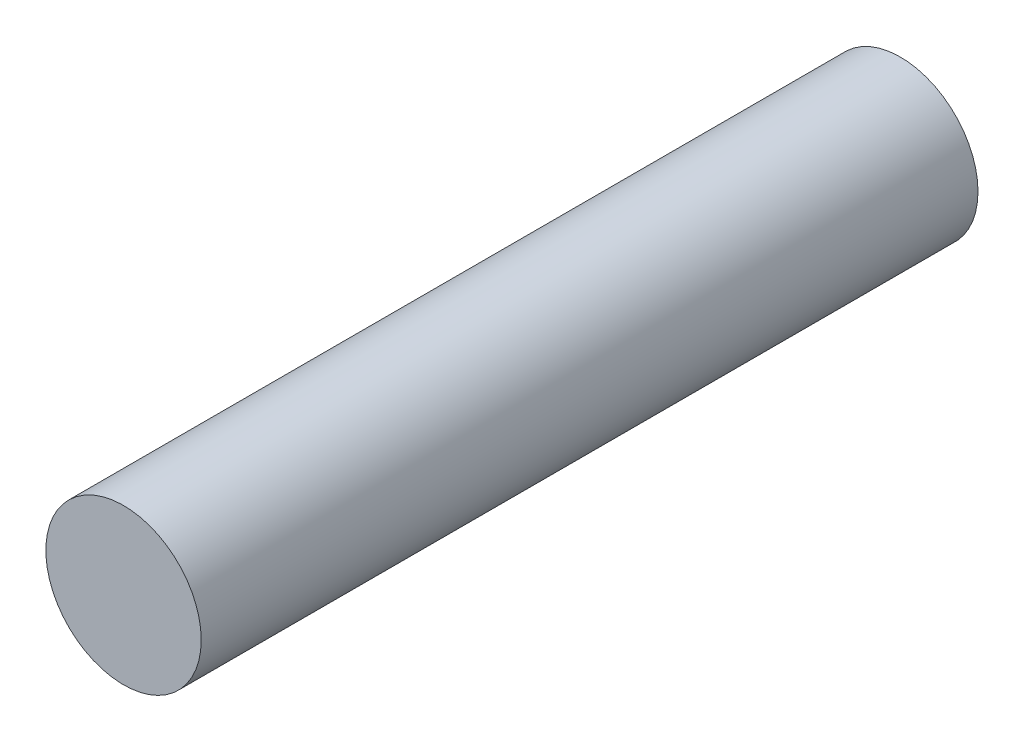
ISO-10303-21;
HEADER;
FILE_DESCRIPTION(('STEP AP214'),'2;1');
FILE_NAME('part.step','',(''),(''),'','','');
FILE_SCHEMA(('AUTOMOTIVE_DESIGN { 1 0 10303 214 1 1 1 1 }'));
ENDSEC;
DATA;
#1=APPLICATION_CONTEXT('core data for automotive mechanical design processes');
#2=APPLICATION_PROTOCOL_DEFINITION('international standard','automotive_design',2000,#1);
#3=PRODUCT_CONTEXT('',#1,'mechanical');
#4=PRODUCT('Part','Part','',(#3));
#5=PRODUCT_RELATED_PRODUCT_CATEGORY('part','',(#4));
#6=PRODUCT_DEFINITION_FORMATION('','',#4);
#7=PRODUCT_DEFINITION_CONTEXT('part definition',#1,'design');
#8=PRODUCT_DEFINITION('design','',#6,#7);
#9=PRODUCT_DEFINITION_SHAPE('','',#8);
#10=(LENGTH_UNIT() NAMED_UNIT(*) SI_UNIT(.MILLI.,.METRE.));
#11=(NAMED_UNIT(*) PLANE_ANGLE_UNIT() SI_UNIT($,.RADIAN.));
#12=(NAMED_UNIT(*) SI_UNIT($,.STERADIAN.) SOLID_ANGLE_UNIT());
#13=UNCERTAINTY_MEASURE_WITH_UNIT(LENGTH_MEASURE(1.E-05),#10,'distance_accuracy_value','');
#14=(GEOMETRIC_REPRESENTATION_CONTEXT(3) GLOBAL_UNCERTAINTY_ASSIGNED_CONTEXT((#13)) GLOBAL_UNIT_ASSIGNED_CONTEXT((#10,
#11,#12)) REPRESENTATION_CONTEXT('',''));
#15=CARTESIAN_POINT('',(0.,0.,0.));
#16=DIRECTION('',(0.,0.,1.));
#17=DIRECTION('',(1.,0.,0.));
#18=AXIS2_PLACEMENT_3D('',#15,#16,#17);
#19=CARTESIAN_POINT('',(0.,0.,-127.));
#20=DIRECTION('',(0.,0.,1.));
#21=DIRECTION('',(1.,0.,0.));
#22=AXIS2_PLACEMENT_3D('',#19,#20,#21);
#23=CYLINDRICAL_SURFACE('',#22,25.4);
#24=CARTESIAN_POINT('',(0.,0.,-127.));
#25=DIRECTION('',(0.,0.,1.));
#26=DIRECTION('',(1.,0.,0.));
#27=AXIS2_PLACEMENT_3D('',#24,#25,#26);
#28=CIRCLE('',#27,25.4);
#29=CARTESIAN_POINT('',(25.4,0.,-127.));
#30=VERTEX_POINT('',#29);
#31=EDGE_CURVE('E10',#30,#30,#28,.T.);
#32=ORIENTED_EDGE('',*,*,#31,.T.);
#33=EDGE_LOOP('',(#32));
#34=FACE_BOUND('',#33,.T.);
#35=CARTESIAN_POINT('',(0.,0.,127.));
#36=DIRECTION('',(0.,0.,1.));
#37=DIRECTION('',(1.,0.,0.));
#38=AXIS2_PLACEMENT_3D('',#35,#36,#37);
#39=CIRCLE('',#38,25.4);
#40=CARTESIAN_POINT('',(25.4,0.,127.));
#41=VERTEX_POINT('',#40);
#42=EDGE_CURVE('E45',#41,#41,#39,.T.);
#43=ORIENTED_EDGE('',*,*,#42,.F.);
#44=EDGE_LOOP('',(#43));
#45=FACE_BOUND('',#44,.T.);
#46=ADVANCED_FACE('F39',(#34,#45),#23,.T.);
#47=CARTESIAN_POINT('',(0.,0.,-127.));
#48=DIRECTION('',(0.,0.,1.));
#49=DIRECTION('',(1.,0.,0.));
#50=AXIS2_PLACEMENT_3D('',#47,#48,#49);
#51=PLANE('',#50);
#52=ORIENTED_EDGE('',*,*,#31,.F.);
#53=EDGE_LOOP('',(#52));
#54=FACE_BOUND('',#53,.T.);
#55=ADVANCED_FACE('F54',(#54),#51,.F.);
#56=CARTESIAN_POINT('',(0.,0.,127.));
#57=DIRECTION('',(0.,0.,1.));
#58=DIRECTION('',(1.,0.,0.));
#59=AXIS2_PLACEMENT_3D('',#56,#57,#58);
#60=PLANE('',#59);
#61=ORIENTED_EDGE('',*,*,#42,.T.);
#62=EDGE_LOOP('',(#61));
#63=FACE_BOUND('',#62,.T.);
#64=ADVANCED_FACE('F51',(#63),#60,.T.);
#65=CLOSED_SHELL('',(#46,#55,#64));
#66=MANIFOLD_SOLID_BREP('B2',#65);
#67=ADVANCED_BREP_SHAPE_REPRESENTATION('',(#18,#66),#14);
#68=SHAPE_DEFINITION_REPRESENTATION(#9,#67);
ENDSEC;
END-ISO-10303-21;
